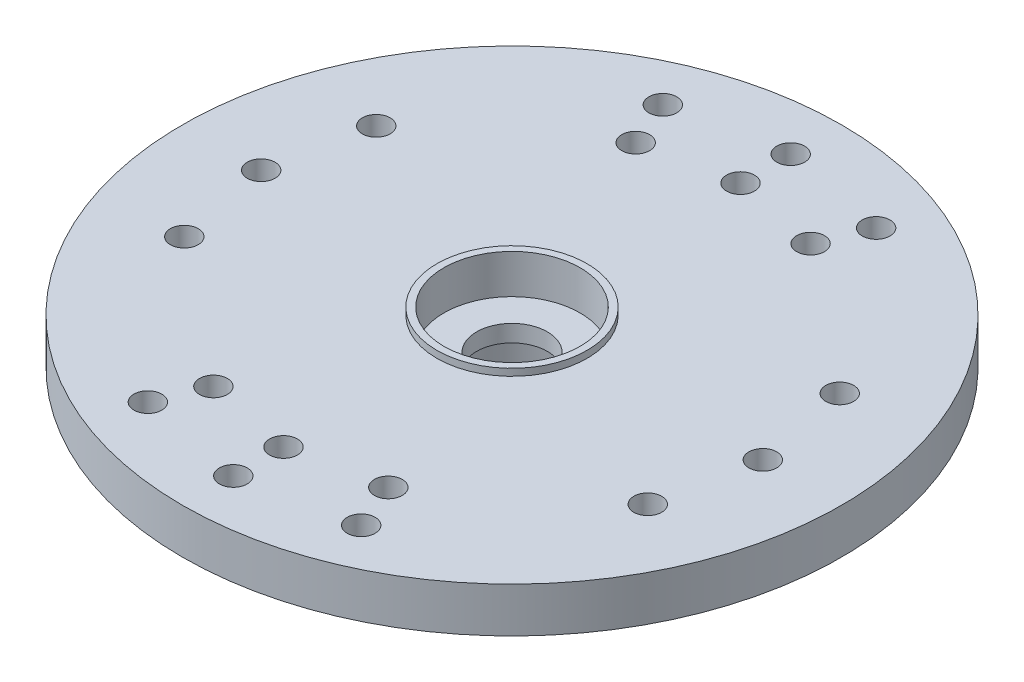
ISO-10303-21;
HEADER;
FILE_DESCRIPTION(('STEP AP214'),'2;1');
FILE_NAME('part.step','',(''),(''),'','','');
FILE_SCHEMA(('AUTOMOTIVE_DESIGN { 1 0 10303 214 1 1 1 1 }'));
ENDSEC;
DATA;
#1=APPLICATION_CONTEXT('core data for automotive mechanical design processes');
#2=APPLICATION_PROTOCOL_DEFINITION('international standard','automotive_design',2000,#1);
#3=PRODUCT_CONTEXT('',#1,'mechanical');
#4=PRODUCT('Part','Part','',(#3));
#5=PRODUCT_RELATED_PRODUCT_CATEGORY('part','',(#4));
#6=PRODUCT_DEFINITION_FORMATION('','',#4);
#7=PRODUCT_DEFINITION_CONTEXT('part definition',#1,'design');
#8=PRODUCT_DEFINITION('design','',#6,#7);
#9=PRODUCT_DEFINITION_SHAPE('','',#8);
#10=(LENGTH_UNIT() NAMED_UNIT(*) SI_UNIT(.MILLI.,.METRE.));
#11=(NAMED_UNIT(*) PLANE_ANGLE_UNIT() SI_UNIT($,.RADIAN.));
#12=(NAMED_UNIT(*) SI_UNIT($,.STERADIAN.) SOLID_ANGLE_UNIT());
#13=UNCERTAINTY_MEASURE_WITH_UNIT(LENGTH_MEASURE(1.E-05),#10,'distance_accuracy_value','');
#14=(GEOMETRIC_REPRESENTATION_CONTEXT(3) GLOBAL_UNCERTAINTY_ASSIGNED_CONTEXT((#13)) GLOBAL_UNIT_ASSIGNED_CONTEXT((#10,
#11,#12)) REPRESENTATION_CONTEXT('',''));
#15=CARTESIAN_POINT('',(0.,0.,0.));
#16=DIRECTION('',(0.,0.,1.));
#17=DIRECTION('',(1.,0.,0.));
#18=AXIS2_PLACEMENT_3D('',#15,#16,#17);
#19=CARTESIAN_POINT('',(0.,1.6129,0.));
#20=DIRECTION('',(0.,1.,0.));
#21=DIRECTION('',(0.,0.,1.));
#22=AXIS2_PLACEMENT_3D('',#19,#20,#21);
#23=PLANE('',#22);
#24=CARTESIAN_POINT('',(0.,1.6129,0.));
#25=DIRECTION('',(0.,1.,0.));
#26=DIRECTION('',(0.,0.,1.));
#27=AXIS2_PLACEMENT_3D('',#24,#25,#26);
#28=CIRCLE('',#27,11.825);
#29=CARTESIAN_POINT('',(0.,1.6129,11.825));
#30=VERTEX_POINT('',#29);
#31=EDGE_CURVE('E44',#30,#30,#28,.T.);
#32=ORIENTED_EDGE('',*,*,#31,.T.);
#33=EDGE_LOOP('',(#32));
#34=FACE_BOUND('',#33,.T.);
#35=CARTESIAN_POINT('',(-9.,1.6129,0.));
#36=DIRECTION('',(0.,1.,0.));
#37=DIRECTION('',(0.,0.,1.));
#38=AXIS2_PLACEMENT_3D('',#35,#36,#37);
#39=CIRCLE('',#38,0.500000000000001);
#40=CARTESIAN_POINT('',(-9.,1.6129,0.500000000000001));
#41=VERTEX_POINT('',#40);
#42=EDGE_CURVE('E120',#41,#41,#39,.T.);
#43=ORIENTED_EDGE('',*,*,#42,.F.);
#44=EDGE_LOOP('',(#43));
#45=FACE_BOUND('',#44,.T.);
#46=CARTESIAN_POINT('',(-8.31491579260157,1.6129,-3.44415089128582));
#47=DIRECTION('',(0.,1.,0.));
#48=DIRECTION('',(0.,0.,1.));
#49=AXIS2_PLACEMENT_3D('',#46,#47,#48);
#50=CIRCLE('',#49,0.500000000000001);
#51=CARTESIAN_POINT('',(-8.31491579260157,1.6129,-2.94415089128582));
#52=VERTEX_POINT('',#51);
#53=EDGE_CURVE('E116',#52,#52,#50,.T.);
#54=ORIENTED_EDGE('',*,*,#53,.F.);
#55=EDGE_LOOP('',(#54));
#56=FACE_BOUND('',#55,.T.);
#57=CARTESIAN_POINT('',(-8.31491579260157,1.6129,3.44415089128582));
#58=DIRECTION('',(0.,1.,0.));
#59=DIRECTION('',(0.,0.,1.));
#60=AXIS2_PLACEMENT_3D('',#57,#58,#59);
#61=CIRCLE('',#60,0.500000000000001);
#62=CARTESIAN_POINT('',(-8.31491579260157,1.6129,3.94415089128582));
#63=VERTEX_POINT('',#62);
#64=EDGE_CURVE('E105',#63,#63,#61,.T.);
#65=ORIENTED_EDGE('',*,*,#64,.F.);
#66=EDGE_LOOP('',(#65));
#67=FACE_BOUND('',#66,.T.);
#68=CARTESIAN_POINT('',(9.,1.6129,0.));
#69=DIRECTION('',(0.,-1.,0.));
#70=DIRECTION('',(0.,0.,1.));
#71=AXIS2_PLACEMENT_3D('',#68,#69,#70);
#72=CIRCLE('',#71,0.500000000000001);
#73=CARTESIAN_POINT('',(9.,1.6129,0.500000000000001));
#74=VERTEX_POINT('',#73);
#75=EDGE_CURVE('E112',#74,#74,#72,.T.);
#76=ORIENTED_EDGE('',*,*,#75,.T.);
#77=EDGE_LOOP('',(#76));
#78=FACE_BOUND('',#77,.T.);
#79=CARTESIAN_POINT('',(8.31491579260157,1.6129,-3.44415089128582));
#80=DIRECTION('',(0.,-1.,0.));
#81=DIRECTION('',(0.,0.,1.));
#82=AXIS2_PLACEMENT_3D('',#79,#80,#81);
#83=CIRCLE('',#82,0.500000000000001);
#84=CARTESIAN_POINT('',(8.31491579260157,1.6129,-2.94415089128582));
#85=VERTEX_POINT('',#84);
#86=EDGE_CURVE('E137',#85,#85,#83,.T.);
#87=ORIENTED_EDGE('',*,*,#86,.T.);
#88=EDGE_LOOP('',(#87));
#89=FACE_BOUND('',#88,.T.);
#90=CARTESIAN_POINT('',(8.31491579260157,1.6129,3.44415089128582));
#91=DIRECTION('',(0.,-1.,0.));
#92=DIRECTION('',(0.,0.,1.));
#93=AXIS2_PLACEMENT_3D('',#90,#91,#92);
#94=CIRCLE('',#93,0.500000000000001);
#95=CARTESIAN_POINT('',(8.31491579260157,1.6129,3.94415089128582));
#96=VERTEX_POINT('',#95);
#97=EDGE_CURVE('E97',#96,#96,#94,.T.);
#98=ORIENTED_EDGE('',*,*,#97,.T.);
#99=EDGE_LOOP('',(#98));
#100=FACE_BOUND('',#99,.T.);
#101=CARTESIAN_POINT('',(0.,1.6129,-10.));
#102=DIRECTION('',(0.,1.,0.));
#103=DIRECTION('',(0.,0.,1.));
#104=AXIS2_PLACEMENT_3D('',#101,#102,#103);
#105=CIRCLE('',#104,0.5);
#106=CARTESIAN_POINT('',(0.,1.6129,-9.5));
#107=VERTEX_POINT('',#106);
#108=EDGE_CURVE('E83',#107,#107,#105,.T.);
#109=ORIENTED_EDGE('',*,*,#108,.F.);
#110=EDGE_LOOP('',(#109));
#111=FACE_BOUND('',#110,.T.);
#112=CARTESIAN_POINT('',(0.,1.6129,-8.2));
#113=DIRECTION('',(0.,1.,0.));
#114=DIRECTION('',(0.,0.,1.));
#115=AXIS2_PLACEMENT_3D('',#112,#113,#114);
#116=CIRCLE('',#115,0.5);
#117=CARTESIAN_POINT('',(0.,1.6129,-7.7));
#118=VERTEX_POINT('',#117);
#119=EDGE_CURVE('E101',#118,#118,#116,.T.);
#120=ORIENTED_EDGE('',*,*,#119,.F.);
#121=EDGE_LOOP('',(#120));
#122=FACE_BOUND('',#121,.T.);
#123=CARTESIAN_POINT('',(-3.13800414539374,1.6129,-7.57581216659255));
#124=DIRECTION('',(0.,1.,0.));
#125=DIRECTION('',(0.382683432365091,0.,0.923879532511287));
#126=AXIS2_PLACEMENT_3D('',#123,#124,#125);
#127=CIRCLE('',#126,0.5);
#128=CARTESIAN_POINT('',(-2.9466624292112,1.6129,-7.11387240033691));
#129=VERTEX_POINT('',#128);
#130=EDGE_CURVE('E93',#129,#129,#127,.T.);
#131=ORIENTED_EDGE('',*,*,#130,.F.);
#132=EDGE_LOOP('',(#131));
#133=FACE_BOUND('',#132,.T.);
#134=CARTESIAN_POINT('',(3.82683432365091,1.6129,-9.23879532511287));
#135=DIRECTION('',(0.,1.,0.));
#136=DIRECTION('',(-0.382683432365091,0.,0.923879532511287));
#137=AXIS2_PLACEMENT_3D('',#134,#135,#136);
#138=CIRCLE('',#137,0.5);
#139=CARTESIAN_POINT('',(3.63549260746836,1.6129,-8.77685555885722));
#140=VERTEX_POINT('',#139);
#141=EDGE_CURVE('E63',#140,#140,#138,.T.);
#142=ORIENTED_EDGE('',*,*,#141,.F.);
#143=EDGE_LOOP('',(#142));
#144=FACE_BOUND('',#143,.T.);
#145=CARTESIAN_POINT('',(3.13800414539374,1.6129,-7.57581216659255));
#146=DIRECTION('',(0.,1.,0.));
#147=DIRECTION('',(-0.382683432365091,0.,0.923879532511287));
#148=AXIS2_PLACEMENT_3D('',#145,#146,#147);
#149=CIRCLE('',#148,0.5);
#150=CARTESIAN_POINT('',(2.9466624292112,1.6129,-7.11387240033691));
#151=VERTEX_POINT('',#150);
#152=EDGE_CURVE('E149',#151,#151,#149,.T.);
#153=ORIENTED_EDGE('',*,*,#152,.F.);
#154=EDGE_LOOP('',(#153));
#155=FACE_BOUND('',#154,.T.);
#156=CARTESIAN_POINT('',(-3.82683432365091,1.6129,-9.23879532511287));
#157=DIRECTION('',(0.,1.,0.));
#158=DIRECTION('',(0.382683432365091,0.,0.923879532511287));
#159=AXIS2_PLACEMENT_3D('',#156,#157,#158);
#160=CIRCLE('',#159,0.5);
#161=CARTESIAN_POINT('',(-3.63549260746836,1.6129,-8.77685555885722));
#162=VERTEX_POINT('',#161);
#163=EDGE_CURVE('E148',#162,#162,#160,.T.);
#164=ORIENTED_EDGE('',*,*,#163,.F.);
#165=EDGE_LOOP('',(#164));
#166=FACE_BOUND('',#165,.T.);
#167=CARTESIAN_POINT('',(0.,1.6129,8.2));
#168=DIRECTION('',(0.,-1.,0.));
#169=DIRECTION('',(0.,0.,-1.));
#170=AXIS2_PLACEMENT_3D('',#167,#168,#169);
#171=CIRCLE('',#170,0.5);
#172=CARTESIAN_POINT('',(0.,1.6129,7.7));
#173=VERTEX_POINT('',#172);
#174=EDGE_CURVE('E79',#173,#173,#171,.T.);
#175=ORIENTED_EDGE('',*,*,#174,.T.);
#176=EDGE_LOOP('',(#175));
#177=FACE_BOUND('',#176,.T.);
#178=CARTESIAN_POINT('',(3.82683432365091,1.6129,9.23879532511287));
#179=DIRECTION('',(0.,-1.,0.));
#180=DIRECTION('',(-0.382683432365091,0.,-0.923879532511287));
#181=AXIS2_PLACEMENT_3D('',#178,#179,#180);
#182=CIRCLE('',#181,0.5);
#183=CARTESIAN_POINT('',(3.63549260746836,1.6129,8.77685555885722));
#184=VERTEX_POINT('',#183);
#185=EDGE_CURVE('E59',#184,#184,#182,.T.);
#186=ORIENTED_EDGE('',*,*,#185,.T.);
#187=EDGE_LOOP('',(#186));
#188=FACE_BOUND('',#187,.T.);
#189=CARTESIAN_POINT('',(0.,1.6129,10.));
#190=DIRECTION('',(0.,-1.,0.));
#191=DIRECTION('',(0.,0.,-1.));
#192=AXIS2_PLACEMENT_3D('',#189,#190,#191);
#193=CIRCLE('',#192,0.5);
#194=CARTESIAN_POINT('',(0.,1.6129,9.5));
#195=VERTEX_POINT('',#194);
#196=EDGE_CURVE('E158',#195,#195,#193,.T.);
#197=ORIENTED_EDGE('',*,*,#196,.T.);
#198=EDGE_LOOP('',(#197));
#199=FACE_BOUND('',#198,.T.);
#200=CARTESIAN_POINT('',(-3.13800414539374,1.6129,7.57581216659255));
#201=DIRECTION('',(0.,-1.,0.));
#202=DIRECTION('',(0.382683432365091,0.,-0.923879532511287));
#203=AXIS2_PLACEMENT_3D('',#200,#201,#202);
#204=CIRCLE('',#203,0.5);
#205=CARTESIAN_POINT('',(-2.9466624292112,1.6129,7.11387240033691));
#206=VERTEX_POINT('',#205);
#207=EDGE_CURVE('E159',#206,#206,#204,.T.);
#208=ORIENTED_EDGE('',*,*,#207,.T.);
#209=EDGE_LOOP('',(#208));
#210=FACE_BOUND('',#209,.T.);
#211=CARTESIAN_POINT('',(-3.82683432365091,1.6129,9.23879532511287));
#212=DIRECTION('',(0.,-1.,0.));
#213=DIRECTION('',(0.382683432365091,0.,-0.923879532511287));
#214=AXIS2_PLACEMENT_3D('',#211,#212,#213);
#215=CIRCLE('',#214,0.5);
#216=CARTESIAN_POINT('',(-3.63549260746836,1.6129,8.77685555885722));
#217=VERTEX_POINT('',#216);
#218=EDGE_CURVE('E162',#217,#217,#215,.T.);
#219=ORIENTED_EDGE('',*,*,#218,.T.);
#220=EDGE_LOOP('',(#219));
#221=FACE_BOUND('',#220,.T.);
#222=CARTESIAN_POINT('',(3.13800414539374,1.6129,7.57581216659255));
#223=DIRECTION('',(0.,-1.,0.));
#224=DIRECTION('',(-0.382683432365091,0.,-0.923879532511287));
#225=AXIS2_PLACEMENT_3D('',#222,#223,#224);
#226=CIRCLE('',#225,0.5);
#227=CARTESIAN_POINT('',(2.9466624292112,1.6129,7.11387240033691));
#228=VERTEX_POINT('',#227);
#229=EDGE_CURVE('E165',#228,#228,#226,.T.);
#230=ORIENTED_EDGE('',*,*,#229,.T.);
#231=EDGE_LOOP('',(#230));
#232=FACE_BOUND('',#231,.T.);
#233=CARTESIAN_POINT('',(0.,1.6129,0.));
#234=DIRECTION('',(0.,1.,0.));
#235=DIRECTION('',(0.,0.,1.));
#236=AXIS2_PLACEMENT_3D('',#233,#234,#235);
#237=CIRCLE('',#236,2.69475);
#238=CARTESIAN_POINT('',(0.,1.6129,2.69475));
#239=VERTEX_POINT('',#238);
#240=EDGE_CURVE('E180',#239,#239,#237,.T.);
#241=ORIENTED_EDGE('',*,*,#240,.F.);
#242=EDGE_LOOP('',(#241));
#243=FACE_BOUND('',#242,.T.);
#244=ADVANCED_FACE('F33',(#34,#45,#56,#67,#78,#89,#100,#111,#122,#133,#144,#155,#166,#177,#188,
#199,#210,#221,#232,#243),#23,.T.);
#245=CARTESIAN_POINT('',(0.,-2.4871,0.));
#246=DIRECTION('',(0.,1.,0.));
#247=DIRECTION('',(0.,0.,1.));
#248=AXIS2_PLACEMENT_3D('',#245,#246,#247);
#249=CYLINDRICAL_SURFACE('',#248,1.27);
#250=CARTESIAN_POINT('',(0.,0.4572,0.));
#251=DIRECTION('',(0.,1.,0.));
#252=DIRECTION('',(0.,0.,1.));
#253=AXIS2_PLACEMENT_3D('',#250,#251,#252);
#254=CIRCLE('',#253,1.27);
#255=CARTESIAN_POINT('',(0.,0.4572,1.27));
#256=VERTEX_POINT('',#255);
#257=EDGE_CURVE('E56',#256,#256,#254,.F.);
#258=ORIENTED_EDGE('',*,*,#257,.F.);
#259=EDGE_LOOP('',(#258));
#260=FACE_BOUND('',#259,.T.);
#261=CARTESIAN_POINT('',(0.,-0.150299999999999,0.));
#262=DIRECTION('',(0.,-1.,0.));
#263=DIRECTION('',(0.,0.,-1.));
#264=AXIS2_PLACEMENT_3D('',#261,#262,#263);
#265=CIRCLE('',#264,1.27);
#266=CARTESIAN_POINT('',(0.,-0.150299999999999,-1.27));
#267=VERTEX_POINT('',#266);
#268=EDGE_CURVE('E51',#267,#267,#265,.F.);
#269=ORIENTED_EDGE('',*,*,#268,.F.);
#270=EDGE_LOOP('',(#269));
#271=FACE_BOUND('',#270,.T.);
#272=ADVANCED_FACE('F207',(#260,#271),#249,.F.);
#273=CARTESIAN_POINT('',(0.,1.6129,0.));
#274=DIRECTION('',(0.,-1.,0.));
#275=DIRECTION('',(0.,0.,-1.));
#276=AXIS2_PLACEMENT_3D('',#273,#274,#275);
#277=CYLINDRICAL_SURFACE('',#276,11.825);
#278=ORIENTED_EDGE('',*,*,#31,.F.);
#279=EDGE_LOOP('',(#278));
#280=FACE_BOUND('',#279,.T.);
#281=CARTESIAN_POINT('',(0.,0.,0.));
#282=DIRECTION('',(0.,1.,0.));
#283=DIRECTION('',(0.,0.,1.));
#284=AXIS2_PLACEMENT_3D('',#281,#282,#283);
#285=CIRCLE('',#284,11.825);
#286=CARTESIAN_POINT('',(0.,0.,11.825));
#287=VERTEX_POINT('',#286);
#288=EDGE_CURVE('E48',#287,#287,#285,.T.);
#289=ORIENTED_EDGE('',*,*,#288,.T.);
#290=EDGE_LOOP('',(#289));
#291=FACE_BOUND('',#290,.T.);
#292=ADVANCED_FACE('F213',(#280,#291),#277,.T.);
#293=CARTESIAN_POINT('',(0.,0.,0.));
#294=DIRECTION('',(0.,1.,0.));
#295=DIRECTION('',(0.,0.,1.));
#296=AXIS2_PLACEMENT_3D('',#293,#294,#295);
#297=PLANE('',#296);
#298=CARTESIAN_POINT('',(0.,0.,0.));
#299=DIRECTION('',(0.,1.,0.));
#300=DIRECTION('',(0.,0.,1.));
#301=AXIS2_PLACEMENT_3D('',#298,#299,#300);
#302=CIRCLE('',#301,3.9);
#303=CARTESIAN_POINT('',(0.,0.,3.9));
#304=VERTEX_POINT('',#303);
#305=EDGE_CURVE('E40',#304,#304,#302,.T.);
#306=ORIENTED_EDGE('',*,*,#305,.T.);
#307=EDGE_LOOP('',(#306));
#308=FACE_BOUND('',#307,.T.);
#309=CARTESIAN_POINT('',(3.13800414539374,0.,7.57581216659255));
#310=DIRECTION('',(0.,1.,0.));
#311=DIRECTION('',(0.,0.,1.));
#312=AXIS2_PLACEMENT_3D('',#309,#310,#311);
#313=CIRCLE('',#312,0.5);
#314=CARTESIAN_POINT('',(3.13800414539374,0.,8.07581216659255));
#315=VERTEX_POINT('',#314);
#316=EDGE_CURVE('E60',#315,#315,#313,.F.);
#317=ORIENTED_EDGE('',*,*,#316,.F.);
#318=EDGE_LOOP('',(#317));
#319=FACE_BOUND('',#318,.T.);
#320=CARTESIAN_POINT('',(-3.82683432365091,0.,9.23879532511287));
#321=DIRECTION('',(0.,1.,0.));
#322=DIRECTION('',(0.,0.,1.));
#323=AXIS2_PLACEMENT_3D('',#320,#321,#322);
#324=CIRCLE('',#323,0.5);
#325=CARTESIAN_POINT('',(-3.82683432365091,0.,9.73879532511287));
#326=VERTEX_POINT('',#325);
#327=EDGE_CURVE('E64',#326,#326,#324,.F.);
#328=ORIENTED_EDGE('',*,*,#327,.F.);
#329=EDGE_LOOP('',(#328));
#330=FACE_BOUND('',#329,.T.);
#331=CARTESIAN_POINT('',(-3.13800414539374,0.,7.57581216659255));
#332=DIRECTION('',(0.,1.,0.));
#333=DIRECTION('',(0.,0.,1.));
#334=AXIS2_PLACEMENT_3D('',#331,#332,#333);
#335=CIRCLE('',#334,0.5);
#336=CARTESIAN_POINT('',(-3.13800414539374,0.,8.07581216659255));
#337=VERTEX_POINT('',#336);
#338=EDGE_CURVE('E67',#337,#337,#335,.F.);
#339=ORIENTED_EDGE('',*,*,#338,.F.);
#340=EDGE_LOOP('',(#339));
#341=FACE_BOUND('',#340,.T.);
#342=CARTESIAN_POINT('',(0.,0.,10.));
#343=DIRECTION('',(0.,1.,0.));
#344=DIRECTION('',(0.,0.,1.));
#345=AXIS2_PLACEMENT_3D('',#342,#343,#344);
#346=CIRCLE('',#345,0.5);
#347=CARTESIAN_POINT('',(0.,0.,10.5));
#348=VERTEX_POINT('',#347);
#349=EDGE_CURVE('E70',#348,#348,#346,.F.);
#350=ORIENTED_EDGE('',*,*,#349,.F.);
#351=EDGE_LOOP('',(#350));
#352=FACE_BOUND('',#351,.T.);
#353=CARTESIAN_POINT('',(3.82683432365091,0.,9.23879532511287));
#354=DIRECTION('',(0.,1.,0.));
#355=DIRECTION('',(0.,0.,1.));
#356=AXIS2_PLACEMENT_3D('',#353,#354,#355);
#357=CIRCLE('',#356,0.5);
#358=CARTESIAN_POINT('',(3.82683432365091,0.,9.73879532511287));
#359=VERTEX_POINT('',#358);
#360=EDGE_CURVE('E73',#359,#359,#357,.F.);
#361=ORIENTED_EDGE('',*,*,#360,.F.);
#362=EDGE_LOOP('',(#361));
#363=FACE_BOUND('',#362,.T.);
#364=CARTESIAN_POINT('',(0.,0.,8.2));
#365=DIRECTION('',(0.,1.,0.));
#366=DIRECTION('',(0.,0.,1.));
#367=AXIS2_PLACEMENT_3D('',#364,#365,#366);
#368=CIRCLE('',#367,0.5);
#369=CARTESIAN_POINT('',(0.,0.,8.7));
#370=VERTEX_POINT('',#369);
#371=EDGE_CURVE('E76',#370,#370,#368,.F.);
#372=ORIENTED_EDGE('',*,*,#371,.F.);
#373=EDGE_LOOP('',(#372));
#374=FACE_BOUND('',#373,.T.);
#375=CARTESIAN_POINT('',(-3.82683432365091,0.,-9.23879532511287));
#376=DIRECTION('',(0.,1.,0.));
#377=DIRECTION('',(0.,0.,1.));
#378=AXIS2_PLACEMENT_3D('',#375,#376,#377);
#379=CIRCLE('',#378,0.5);
#380=CARTESIAN_POINT('',(-3.82683432365091,0.,-8.73879532511287));
#381=VERTEX_POINT('',#380);
#382=EDGE_CURVE('E80',#381,#381,#379,.T.);
#383=ORIENTED_EDGE('',*,*,#382,.T.);
#384=EDGE_LOOP('',(#383));
#385=FACE_BOUND('',#384,.T.);
#386=CARTESIAN_POINT('',(3.13800414539374,0.,-7.57581216659255));
#387=DIRECTION('',(0.,1.,0.));
#388=DIRECTION('',(0.,0.,1.));
#389=AXIS2_PLACEMENT_3D('',#386,#387,#388);
#390=CIRCLE('',#389,0.5);
#391=CARTESIAN_POINT('',(3.13800414539374,0.,-7.07581216659255));
#392=VERTEX_POINT('',#391);
#393=EDGE_CURVE('E84',#392,#392,#390,.T.);
#394=ORIENTED_EDGE('',*,*,#393,.T.);
#395=EDGE_LOOP('',(#394));
#396=FACE_BOUND('',#395,.T.);
#397=CARTESIAN_POINT('',(3.82683432365091,0.,-9.23879532511287));
#398=DIRECTION('',(0.,1.,0.));
#399=DIRECTION('',(0.,0.,1.));
#400=AXIS2_PLACEMENT_3D('',#397,#398,#399);
#401=CIRCLE('',#400,0.5);
#402=CARTESIAN_POINT('',(3.82683432365091,0.,-8.73879532511287));
#403=VERTEX_POINT('',#402);
#404=EDGE_CURVE('E87',#403,#403,#401,.T.);
#405=ORIENTED_EDGE('',*,*,#404,.T.);
#406=EDGE_LOOP('',(#405));
#407=FACE_BOUND('',#406,.T.);
#408=CARTESIAN_POINT('',(-3.13800414539374,0.,-7.57581216659255));
#409=DIRECTION('',(0.,1.,0.));
#410=DIRECTION('',(0.,0.,1.));
#411=AXIS2_PLACEMENT_3D('',#408,#409,#410);
#412=CIRCLE('',#411,0.5);
#413=CARTESIAN_POINT('',(-3.13800414539374,0.,-7.07581216659255));
#414=VERTEX_POINT('',#413);
#415=EDGE_CURVE('E90',#414,#414,#412,.T.);
#416=ORIENTED_EDGE('',*,*,#415,.T.);
#417=EDGE_LOOP('',(#416));
#418=FACE_BOUND('',#417,.T.);
#419=CARTESIAN_POINT('',(0.,0.,-8.2));
#420=DIRECTION('',(0.,1.,0.));
#421=DIRECTION('',(0.,0.,1.));
#422=AXIS2_PLACEMENT_3D('',#419,#420,#421);
#423=CIRCLE('',#422,0.5);
#424=CARTESIAN_POINT('',(0.,0.,-7.7));
#425=VERTEX_POINT('',#424);
#426=EDGE_CURVE('E94',#425,#425,#423,.T.);
#427=ORIENTED_EDGE('',*,*,#426,.T.);
#428=EDGE_LOOP('',(#427));
#429=FACE_BOUND('',#428,.T.);
#430=CARTESIAN_POINT('',(0.,0.,-10.));
#431=DIRECTION('',(0.,1.,0.));
#432=DIRECTION('',(0.,0.,1.));
#433=AXIS2_PLACEMENT_3D('',#430,#431,#432);
#434=CIRCLE('',#433,0.5);
#435=CARTESIAN_POINT('',(0.,0.,-9.5));
#436=VERTEX_POINT('',#435);
#437=EDGE_CURVE('E98',#436,#436,#434,.T.);
#438=ORIENTED_EDGE('',*,*,#437,.T.);
#439=EDGE_LOOP('',(#438));
#440=FACE_BOUND('',#439,.T.);
#441=CARTESIAN_POINT('',(8.31491579260157,0.,3.44415089128582));
#442=DIRECTION('',(0.,1.,0.));
#443=DIRECTION('',(0.,0.,1.));
#444=AXIS2_PLACEMENT_3D('',#441,#442,#443);
#445=CIRCLE('',#444,0.500000000000001);
#446=CARTESIAN_POINT('',(8.31491579260157,0.,3.94415089128582));
#447=VERTEX_POINT('',#446);
#448=EDGE_CURVE('E102',#447,#447,#445,.F.);
#449=ORIENTED_EDGE('',*,*,#448,.F.);
#450=EDGE_LOOP('',(#449));
#451=FACE_BOUND('',#450,.T.);
#452=CARTESIAN_POINT('',(8.31491579260157,0.,-3.44415089128582));
#453=DIRECTION('',(0.,1.,0.));
#454=DIRECTION('',(0.,0.,1.));
#455=AXIS2_PLACEMENT_3D('',#452,#453,#454);
#456=CIRCLE('',#455,0.500000000000001);
#457=CARTESIAN_POINT('',(8.31491579260157,0.,-2.94415089128582));
#458=VERTEX_POINT('',#457);
#459=EDGE_CURVE('E106',#458,#458,#456,.F.);
#460=ORIENTED_EDGE('',*,*,#459,.F.);
#461=EDGE_LOOP('',(#460));
#462=FACE_BOUND('',#461,.T.);
#463=CARTESIAN_POINT('',(9.,0.,0.));
#464=DIRECTION('',(0.,1.,0.));
#465=DIRECTION('',(0.,0.,1.));
#466=AXIS2_PLACEMENT_3D('',#463,#464,#465);
#467=CIRCLE('',#466,0.500000000000001);
#468=CARTESIAN_POINT('',(9.,0.,0.500000000000001));
#469=VERTEX_POINT('',#468);
#470=EDGE_CURVE('E109',#469,#469,#467,.F.);
#471=ORIENTED_EDGE('',*,*,#470,.F.);
#472=EDGE_LOOP('',(#471));
#473=FACE_BOUND('',#472,.T.);
#474=CARTESIAN_POINT('',(-8.31491579260157,0.,3.44415089128582));
#475=DIRECTION('',(0.,1.,0.));
#476=DIRECTION('',(0.,0.,1.));
#477=AXIS2_PLACEMENT_3D('',#474,#475,#476);
#478=CIRCLE('',#477,0.500000000000001);
#479=CARTESIAN_POINT('',(-8.31491579260157,0.,3.94415089128582));
#480=VERTEX_POINT('',#479);
#481=EDGE_CURVE('E113',#480,#480,#478,.T.);
#482=ORIENTED_EDGE('',*,*,#481,.T.);
#483=EDGE_LOOP('',(#482));
#484=FACE_BOUND('',#483,.T.);
#485=CARTESIAN_POINT('',(-8.31491579260157,0.,-3.44415089128582));
#486=DIRECTION('',(0.,1.,0.));
#487=DIRECTION('',(0.,0.,1.));
#488=AXIS2_PLACEMENT_3D('',#485,#486,#487);
#489=CIRCLE('',#488,0.500000000000001);
#490=CARTESIAN_POINT('',(-8.31491579260157,0.,-2.94415089128582));
#491=VERTEX_POINT('',#490);
#492=EDGE_CURVE('E117',#491,#491,#489,.T.);
#493=ORIENTED_EDGE('',*,*,#492,.T.);
#494=EDGE_LOOP('',(#493));
#495=FACE_BOUND('',#494,.T.);
#496=CARTESIAN_POINT('',(-9.,0.,0.));
#497=DIRECTION('',(0.,1.,0.));
#498=DIRECTION('',(0.,0.,1.));
#499=AXIS2_PLACEMENT_3D('',#496,#497,#498);
#500=CIRCLE('',#499,0.500000000000001);
#501=CARTESIAN_POINT('',(-9.,0.,0.500000000000001));
#502=VERTEX_POINT('',#501);
#503=EDGE_CURVE('E121',#502,#502,#500,.T.);
#504=ORIENTED_EDGE('',*,*,#503,.T.);
#505=EDGE_LOOP('',(#504));
#506=FACE_BOUND('',#505,.T.);
#507=ORIENTED_EDGE('',*,*,#288,.F.);
#508=EDGE_LOOP('',(#507));
#509=FACE_BOUND('',#508,.T.);
#510=ADVANCED_FACE('F221',(#308,#319,#330,#341,#352,#363,#374,#385,#396,#407,#418,#429,#440,
#451,#462,#473,#484,#495,#506,#509),#297,.F.);
#511=CARTESIAN_POINT('',(0.,-2.4871,0.));
#512=DIRECTION('',(0.,1.,0.));
#513=DIRECTION('',(0.,0.,1.));
#514=AXIS2_PLACEMENT_3D('',#511,#512,#513);
#515=CYLINDRICAL_SURFACE('',#514,3.4);
#516=CARTESIAN_POINT('',(0.,-0.5,0.));
#517=DIRECTION('',(0.,1.,0.));
#518=DIRECTION('',(0.,0.,1.));
#519=AXIS2_PLACEMENT_3D('',#516,#517,#518);
#520=CIRCLE('',#519,3.4);
#521=CARTESIAN_POINT('',(0.,-0.5,3.4));
#522=VERTEX_POINT('',#521);
#523=EDGE_CURVE('E10',#522,#522,#520,.F.);
#524=ORIENTED_EDGE('',*,*,#523,.T.);
#525=EDGE_LOOP('',(#524));
#526=FACE_BOUND('',#525,.T.);
#527=CARTESIAN_POINT('',(0.,-2.4871,0.));
#528=DIRECTION('',(0.,1.,0.));
#529=DIRECTION('',(0.,0.,1.));
#530=AXIS2_PLACEMENT_3D('',#527,#528,#529);
#531=CIRCLE('',#530,3.4);
#532=CARTESIAN_POINT('',(0.,-2.4871,3.4));
#533=VERTEX_POINT('',#532);
#534=EDGE_CURVE('E124',#533,#533,#531,.T.);
#535=ORIENTED_EDGE('',*,*,#534,.T.);
#536=EDGE_LOOP('',(#535));
#537=FACE_BOUND('',#536,.T.);
#538=ADVANCED_FACE('F219',(#526,#537),#515,.T.);
#539=CARTESIAN_POINT('',(0.,-2.4871,0.));
#540=DIRECTION('',(0.,1.,0.));
#541=DIRECTION('',(0.,0.,1.));
#542=AXIS2_PLACEMENT_3D('',#539,#540,#541);
#543=PLANE('',#542);
#544=CARTESIAN_POINT('',(0.,-2.4871,0.));
#545=DIRECTION('',(0.,-1.,0.));
#546=DIRECTION('',(0.,0.,-1.));
#547=AXIS2_PLACEMENT_3D('',#544,#545,#546);
#548=CIRCLE('',#547,2.286);
#549=CARTESIAN_POINT('',(0.,-2.4871,-2.286));
#550=VERTEX_POINT('',#549);
#551=EDGE_CURVE('E176',#550,#550,#548,.T.);
#552=ORIENTED_EDGE('',*,*,#551,.F.);
#553=EDGE_LOOP('',(#552));
#554=FACE_BOUND('',#553,.T.);
#555=ORIENTED_EDGE('',*,*,#534,.F.);
#556=EDGE_LOOP('',(#555));
#557=FACE_BOUND('',#556,.T.);
#558=ADVANCED_FACE('F245',(#554,#557),#543,.F.);
#559=CARTESIAN_POINT('',(-9.,-2.4871,0.));
#560=DIRECTION('',(0.,1.,0.));
#561=DIRECTION('',(0.,0.,1.));
#562=AXIS2_PLACEMENT_3D('',#559,#560,#561);
#563=CYLINDRICAL_SURFACE('',#562,0.500000000000001);
#564=ORIENTED_EDGE('',*,*,#42,.T.);
#565=EDGE_LOOP('',(#564));
#566=FACE_BOUND('',#565,.T.);
#567=ORIENTED_EDGE('',*,*,#503,.F.);
#568=EDGE_LOOP('',(#567));
#569=FACE_BOUND('',#568,.T.);
#570=ADVANCED_FACE('F252',(#566,#569),#563,.F.);
#571=CARTESIAN_POINT('',(-8.31491579260157,-2.4871,-3.44415089128582));
#572=DIRECTION('',(0.,1.,0.));
#573=DIRECTION('',(0.,0.,1.));
#574=AXIS2_PLACEMENT_3D('',#571,#572,#573);
#575=CYLINDRICAL_SURFACE('',#574,0.500000000000001);
#576=ORIENTED_EDGE('',*,*,#53,.T.);
#577=EDGE_LOOP('',(#576));
#578=FACE_BOUND('',#577,.T.);
#579=ORIENTED_EDGE('',*,*,#492,.F.);
#580=EDGE_LOOP('',(#579));
#581=FACE_BOUND('',#580,.T.);
#582=ADVANCED_FACE('F259',(#578,#581),#575,.F.);
#583=CARTESIAN_POINT('',(-8.31491579260157,-2.4871,3.44415089128582));
#584=DIRECTION('',(0.,1.,0.));
#585=DIRECTION('',(0.,0.,1.));
#586=AXIS2_PLACEMENT_3D('',#583,#584,#585);
#587=CYLINDRICAL_SURFACE('',#586,0.500000000000001);
#588=ORIENTED_EDGE('',*,*,#64,.T.);
#589=EDGE_LOOP('',(#588));
#590=FACE_BOUND('',#589,.T.);
#591=ORIENTED_EDGE('',*,*,#481,.F.);
#592=EDGE_LOOP('',(#591));
#593=FACE_BOUND('',#592,.T.);
#594=ADVANCED_FACE('F267',(#590,#593),#587,.F.);
#595=CARTESIAN_POINT('',(9.,-2.4871,0.));
#596=DIRECTION('',(0.,1.,0.));
#597=DIRECTION('',(0.,0.,1.));
#598=AXIS2_PLACEMENT_3D('',#595,#596,#597);
#599=CYLINDRICAL_SURFACE('',#598,0.500000000000001);
#600=ORIENTED_EDGE('',*,*,#75,.F.);
#601=EDGE_LOOP('',(#600));
#602=FACE_BOUND('',#601,.T.);
#603=ORIENTED_EDGE('',*,*,#470,.T.);
#604=EDGE_LOOP('',(#603));
#605=FACE_BOUND('',#604,.T.);
#606=ADVANCED_FACE('F275',(#602,#605),#599,.F.);
#607=CARTESIAN_POINT('',(8.31491579260157,-2.4871,-3.44415089128582));
#608=DIRECTION('',(0.,1.,0.));
#609=DIRECTION('',(0.,0.,1.));
#610=AXIS2_PLACEMENT_3D('',#607,#608,#609);
#611=CYLINDRICAL_SURFACE('',#610,0.500000000000001);
#612=ORIENTED_EDGE('',*,*,#86,.F.);
#613=EDGE_LOOP('',(#612));
#614=FACE_BOUND('',#613,.T.);
#615=ORIENTED_EDGE('',*,*,#459,.T.);
#616=EDGE_LOOP('',(#615));
#617=FACE_BOUND('',#616,.T.);
#618=ADVANCED_FACE('F284',(#614,#617),#611,.F.);
#619=CARTESIAN_POINT('',(8.31491579260157,-2.4871,3.44415089128582));
#620=DIRECTION('',(0.,1.,0.));
#621=DIRECTION('',(0.,0.,1.));
#622=AXIS2_PLACEMENT_3D('',#619,#620,#621);
#623=CYLINDRICAL_SURFACE('',#622,0.500000000000001);
#624=ORIENTED_EDGE('',*,*,#97,.F.);
#625=EDGE_LOOP('',(#624));
#626=FACE_BOUND('',#625,.T.);
#627=ORIENTED_EDGE('',*,*,#448,.T.);
#628=EDGE_LOOP('',(#627));
#629=FACE_BOUND('',#628,.T.);
#630=ADVANCED_FACE('F291',(#626,#629),#623,.F.);
#631=CARTESIAN_POINT('',(0.,-2.4871,-10.));
#632=DIRECTION('',(0.,1.,0.));
#633=DIRECTION('',(0.,0.,1.));
#634=AXIS2_PLACEMENT_3D('',#631,#632,#633);
#635=CYLINDRICAL_SURFACE('',#634,0.5);
#636=ORIENTED_EDGE('',*,*,#108,.T.);
#637=EDGE_LOOP('',(#636));
#638=FACE_BOUND('',#637,.T.);
#639=ORIENTED_EDGE('',*,*,#437,.F.);
#640=EDGE_LOOP('',(#639));
#641=FACE_BOUND('',#640,.T.);
#642=ADVANCED_FACE('F299',(#638,#641),#635,.F.);
#643=CARTESIAN_POINT('',(0.,-2.4871,-8.2));
#644=DIRECTION('',(0.,1.,0.));
#645=DIRECTION('',(0.,0.,1.));
#646=AXIS2_PLACEMENT_3D('',#643,#644,#645);
#647=CYLINDRICAL_SURFACE('',#646,0.5);
#648=ORIENTED_EDGE('',*,*,#119,.T.);
#649=EDGE_LOOP('',(#648));
#650=FACE_BOUND('',#649,.T.);
#651=ORIENTED_EDGE('',*,*,#426,.F.);
#652=EDGE_LOOP('',(#651));
#653=FACE_BOUND('',#652,.T.);
#654=ADVANCED_FACE('F308',(#650,#653),#647,.F.);
#655=CARTESIAN_POINT('',(-3.13800414539374,-2.4871,-7.57581216659255));
#656=DIRECTION('',(0.,1.,0.));
#657=DIRECTION('',(0.,0.,1.));
#658=AXIS2_PLACEMENT_3D('',#655,#656,#657);
#659=CYLINDRICAL_SURFACE('',#658,0.5);
#660=ORIENTED_EDGE('',*,*,#130,.T.);
#661=EDGE_LOOP('',(#660));
#662=FACE_BOUND('',#661,.T.);
#663=ORIENTED_EDGE('',*,*,#415,.F.);
#664=EDGE_LOOP('',(#663));
#665=FACE_BOUND('',#664,.T.);
#666=ADVANCED_FACE('F316',(#662,#665),#659,.F.);
#667=CARTESIAN_POINT('',(3.82683432365091,-2.4871,-9.23879532511287));
#668=DIRECTION('',(0.,1.,0.));
#669=DIRECTION('',(0.,0.,1.));
#670=AXIS2_PLACEMENT_3D('',#667,#668,#669);
#671=CYLINDRICAL_SURFACE('',#670,0.5);
#672=ORIENTED_EDGE('',*,*,#141,.T.);
#673=EDGE_LOOP('',(#672));
#674=FACE_BOUND('',#673,.T.);
#675=ORIENTED_EDGE('',*,*,#404,.F.);
#676=EDGE_LOOP('',(#675));
#677=FACE_BOUND('',#676,.T.);
#678=ADVANCED_FACE('F324',(#674,#677),#671,.F.);
#679=CARTESIAN_POINT('',(3.13800414539374,-2.4871,-7.57581216659255));
#680=DIRECTION('',(0.,1.,0.));
#681=DIRECTION('',(0.,0.,1.));
#682=AXIS2_PLACEMENT_3D('',#679,#680,#681);
#683=CYLINDRICAL_SURFACE('',#682,0.5);
#684=ORIENTED_EDGE('',*,*,#152,.T.);
#685=EDGE_LOOP('',(#684));
#686=FACE_BOUND('',#685,.T.);
#687=ORIENTED_EDGE('',*,*,#393,.F.);
#688=EDGE_LOOP('',(#687));
#689=FACE_BOUND('',#688,.T.);
#690=ADVANCED_FACE('F332',(#686,#689),#683,.F.);
#691=CARTESIAN_POINT('',(-3.82683432365091,-2.4871,-9.23879532511287));
#692=DIRECTION('',(0.,1.,0.));
#693=DIRECTION('',(0.,0.,1.));
#694=AXIS2_PLACEMENT_3D('',#691,#692,#693);
#695=CYLINDRICAL_SURFACE('',#694,0.5);
#696=ORIENTED_EDGE('',*,*,#163,.T.);
#697=EDGE_LOOP('',(#696));
#698=FACE_BOUND('',#697,.T.);
#699=ORIENTED_EDGE('',*,*,#382,.F.);
#700=EDGE_LOOP('',(#699));
#701=FACE_BOUND('',#700,.T.);
#702=ADVANCED_FACE('F340',(#698,#701),#695,.F.);
#703=CARTESIAN_POINT('',(0.,-2.4871,8.2));
#704=DIRECTION('',(0.,1.,0.));
#705=DIRECTION('',(0.,0.,1.));
#706=AXIS2_PLACEMENT_3D('',#703,#704,#705);
#707=CYLINDRICAL_SURFACE('',#706,0.5);
#708=ORIENTED_EDGE('',*,*,#174,.F.);
#709=EDGE_LOOP('',(#708));
#710=FACE_BOUND('',#709,.T.);
#711=ORIENTED_EDGE('',*,*,#371,.T.);
#712=EDGE_LOOP('',(#711));
#713=FACE_BOUND('',#712,.T.);
#714=ADVANCED_FACE('F348',(#710,#713),#707,.F.);
#715=CARTESIAN_POINT('',(3.82683432365091,-2.4871,9.23879532511287));
#716=DIRECTION('',(0.,1.,0.));
#717=DIRECTION('',(0.,0.,1.));
#718=AXIS2_PLACEMENT_3D('',#715,#716,#717);
#719=CYLINDRICAL_SURFACE('',#718,0.5);
#720=ORIENTED_EDGE('',*,*,#185,.F.);
#721=EDGE_LOOP('',(#720));
#722=FACE_BOUND('',#721,.T.);
#723=ORIENTED_EDGE('',*,*,#360,.T.);
#724=EDGE_LOOP('',(#723));
#725=FACE_BOUND('',#724,.T.);
#726=ADVANCED_FACE('F356',(#722,#725),#719,.F.);
#727=CARTESIAN_POINT('',(0.,-2.4871,10.));
#728=DIRECTION('',(0.,1.,0.));
#729=DIRECTION('',(0.,0.,1.));
#730=AXIS2_PLACEMENT_3D('',#727,#728,#729);
#731=CYLINDRICAL_SURFACE('',#730,0.5);
#732=ORIENTED_EDGE('',*,*,#196,.F.);
#733=EDGE_LOOP('',(#732));
#734=FACE_BOUND('',#733,.T.);
#735=ORIENTED_EDGE('',*,*,#349,.T.);
#736=EDGE_LOOP('',(#735));
#737=FACE_BOUND('',#736,.T.);
#738=ADVANCED_FACE('F364',(#734,#737),#731,.F.);
#739=CARTESIAN_POINT('',(-3.13800414539374,-2.4871,7.57581216659255));
#740=DIRECTION('',(0.,1.,0.));
#741=DIRECTION('',(0.,0.,1.));
#742=AXIS2_PLACEMENT_3D('',#739,#740,#741);
#743=CYLINDRICAL_SURFACE('',#742,0.5);
#744=ORIENTED_EDGE('',*,*,#207,.F.);
#745=EDGE_LOOP('',(#744));
#746=FACE_BOUND('',#745,.T.);
#747=ORIENTED_EDGE('',*,*,#338,.T.);
#748=EDGE_LOOP('',(#747));
#749=FACE_BOUND('',#748,.T.);
#750=ADVANCED_FACE('F372',(#746,#749),#743,.F.);
#751=CARTESIAN_POINT('',(-3.82683432365091,-2.4871,9.23879532511287));
#752=DIRECTION('',(0.,1.,0.));
#753=DIRECTION('',(0.,0.,1.));
#754=AXIS2_PLACEMENT_3D('',#751,#752,#753);
#755=CYLINDRICAL_SURFACE('',#754,0.5);
#756=ORIENTED_EDGE('',*,*,#218,.F.);
#757=EDGE_LOOP('',(#756));
#758=FACE_BOUND('',#757,.T.);
#759=ORIENTED_EDGE('',*,*,#327,.T.);
#760=EDGE_LOOP('',(#759));
#761=FACE_BOUND('',#760,.T.);
#762=ADVANCED_FACE('F380',(#758,#761),#755,.F.);
#763=CARTESIAN_POINT('',(3.13800414539374,-2.4871,7.57581216659255));
#764=DIRECTION('',(0.,1.,0.));
#765=DIRECTION('',(0.,0.,1.));
#766=AXIS2_PLACEMENT_3D('',#763,#764,#765);
#767=CYLINDRICAL_SURFACE('',#766,0.5);
#768=ORIENTED_EDGE('',*,*,#229,.F.);
#769=EDGE_LOOP('',(#768));
#770=FACE_BOUND('',#769,.T.);
#771=ORIENTED_EDGE('',*,*,#316,.T.);
#772=EDGE_LOOP('',(#771));
#773=FACE_BOUND('',#772,.T.);
#774=ADVANCED_FACE('F388',(#770,#773),#767,.F.);
#775=CARTESIAN_POINT('',(0.,0.4572,0.));
#776=DIRECTION('',(0.,1.,0.));
#777=DIRECTION('',(0.,0.,1.));
#778=AXIS2_PLACEMENT_3D('',#775,#776,#777);
#779=PLANE('',#778);
#780=CARTESIAN_POINT('',(0.,0.4572,0.));
#781=DIRECTION('',(0.,1.,0.));
#782=DIRECTION('',(0.,0.,1.));
#783=AXIS2_PLACEMENT_3D('',#780,#781,#782);
#784=CIRCLE('',#783,2.44475);
#785=CARTESIAN_POINT('',(0.,0.4572,2.44475));
#786=VERTEX_POINT('',#785);
#787=EDGE_CURVE('E54',#786,#786,#784,.T.);
#788=ORIENTED_EDGE('',*,*,#787,.T.);
#789=EDGE_LOOP('',(#788));
#790=FACE_BOUND('',#789,.T.);
#791=ORIENTED_EDGE('',*,*,#257,.T.);
#792=EDGE_LOOP('',(#791));
#793=FACE_BOUND('',#792,.T.);
#794=ADVANCED_FACE('F396',(#790,#793),#779,.T.);
#795=CARTESIAN_POINT('',(0.,0.4572,0.));
#796=DIRECTION('',(0.,1.,0.));
#797=DIRECTION('',(0.,0.,1.));
#798=AXIS2_PLACEMENT_3D('',#795,#796,#797);
#799=CYLINDRICAL_SURFACE('',#798,2.44475);
#800=ORIENTED_EDGE('',*,*,#787,.F.);
#801=EDGE_LOOP('',(#800));
#802=FACE_BOUND('',#801,.T.);
#803=CARTESIAN_POINT('',(0.,1.8629,0.));
#804=DIRECTION('',(0.,1.,0.));
#805=DIRECTION('',(0.,0.,1.));
#806=AXIS2_PLACEMENT_3D('',#803,#804,#805);
#807=CIRCLE('',#806,2.44475);
#808=CARTESIAN_POINT('',(0.,1.8629,2.44475));
#809=VERTEX_POINT('',#808);
#810=EDGE_CURVE('E183',#809,#809,#807,.T.);
#811=ORIENTED_EDGE('',*,*,#810,.T.);
#812=EDGE_LOOP('',(#811));
#813=FACE_BOUND('',#812,.T.);
#814=ADVANCED_FACE('F189',(#802,#813),#799,.F.);
#815=CARTESIAN_POINT('',(0.,-0.150299999999999,0.));
#816=DIRECTION('',(0.,-1.,0.));
#817=DIRECTION('',(0.,0.,-1.));
#818=AXIS2_PLACEMENT_3D('',#815,#816,#817);
#819=PLANE('',#818);
#820=CARTESIAN_POINT('',(0.,-0.150299999999999,0.));
#821=DIRECTION('',(0.,-1.,0.));
#822=DIRECTION('',(0.,0.,-1.));
#823=AXIS2_PLACEMENT_3D('',#820,#821,#822);
#824=CIRCLE('',#823,2.08155649107262);
#825=CARTESIAN_POINT('',(0.,-0.150299999999999,-2.08155649107262));
#826=VERTEX_POINT('',#825);
#827=EDGE_CURVE('E55',#826,#826,#824,.T.);
#828=ORIENTED_EDGE('',*,*,#827,.T.);
#829=EDGE_LOOP('',(#828));
#830=FACE_BOUND('',#829,.T.);
#831=ORIENTED_EDGE('',*,*,#268,.T.);
#832=EDGE_LOOP('',(#831));
#833=FACE_BOUND('',#832,.T.);
#834=ADVANCED_FACE('F203',(#830,#833),#819,.T.);
#835=CARTESIAN_POINT('',(0.,-2.4871,0.));
#836=DIRECTION('',(0.,-1.,0.));
#837=DIRECTION('',(0.,0.,-1.));
#838=AXIS2_PLACEMENT_3D('',#835,#836,#837);
#839=CONICAL_SURFACE('',#838,2.286,0.0872664625997165);
#840=ORIENTED_EDGE('',*,*,#827,.F.);
#841=EDGE_LOOP('',(#840));
#842=FACE_BOUND('',#841,.T.);
#843=ORIENTED_EDGE('',*,*,#551,.T.);
#844=EDGE_LOOP('',(#843));
#845=FACE_BOUND('',#844,.T.);
#846=ADVANCED_FACE('F194',(#842,#845),#839,.F.);
#847=CARTESIAN_POINT('',(0.,1.8629,0.));
#848=DIRECTION('',(0.,1.,0.));
#849=DIRECTION('',(0.,0.,1.));
#850=AXIS2_PLACEMENT_3D('',#847,#848,#849);
#851=PLANE('',#850);
#852=CARTESIAN_POINT('',(0.,1.8629,0.));
#853=DIRECTION('',(0.,1.,0.));
#854=DIRECTION('',(0.,0.,1.));
#855=AXIS2_PLACEMENT_3D('',#852,#853,#854);
#856=CIRCLE('',#855,2.69475);
#857=CARTESIAN_POINT('',(0.,1.8629,2.69475));
#858=VERTEX_POINT('',#857);
#859=EDGE_CURVE('E179',#858,#858,#856,.T.);
#860=ORIENTED_EDGE('',*,*,#859,.T.);
#861=EDGE_LOOP('',(#860));
#862=FACE_BOUND('',#861,.T.);
#863=ORIENTED_EDGE('',*,*,#810,.F.);
#864=EDGE_LOOP('',(#863));
#865=FACE_BOUND('',#864,.T.);
#866=ADVANCED_FACE('F191',(#862,#865),#851,.T.);
#867=CARTESIAN_POINT('',(0.,1.8629,0.));
#868=DIRECTION('',(0.,-1.,0.));
#869=DIRECTION('',(0.,0.,-1.));
#870=AXIS2_PLACEMENT_3D('',#867,#868,#869);
#871=CYLINDRICAL_SURFACE('',#870,2.69475);
#872=ORIENTED_EDGE('',*,*,#859,.F.);
#873=EDGE_LOOP('',(#872));
#874=FACE_BOUND('',#873,.T.);
#875=ORIENTED_EDGE('',*,*,#240,.T.);
#876=EDGE_LOOP('',(#875));
#877=FACE_BOUND('',#876,.T.);
#878=ADVANCED_FACE('F193',(#874,#877),#871,.T.);
#879=CARTESIAN_POINT('',(0.,-0.5,0.));
#880=DIRECTION('',(0.,1.,0.));
#881=DIRECTION('',(0.,0.,1.));
#882=AXIS2_PLACEMENT_3D('',#879,#880,#881);
#883=TOROIDAL_SURFACE('',#882,3.9,0.5);
#884=ORIENTED_EDGE('',*,*,#523,.F.);
#885=EDGE_LOOP('',(#884));
#886=FACE_BOUND('',#885,.T.);
#887=ORIENTED_EDGE('',*,*,#305,.F.);
#888=EDGE_LOOP('',(#887));
#889=FACE_BOUND('',#888,.T.);
#890=ADVANCED_FACE('F35',(#886,#889),#883,.F.);
#891=CLOSED_SHELL('',(#244,#272,#292,#510,#538,#558,#570,#582,#594,#606,#618,#630,#642,#654,
#666,#678,#690,#702,#714,#726,#738,#750,#762,#774,#794,#814,#834,#846,#866,#878,#890));
#892=MANIFOLD_SOLID_BREP('B2',#891);
#893=ADVANCED_BREP_SHAPE_REPRESENTATION('',(#18,#892),#14);
#894=SHAPE_DEFINITION_REPRESENTATION(#9,#893);
ENDSEC;
END-ISO-10303-21;
